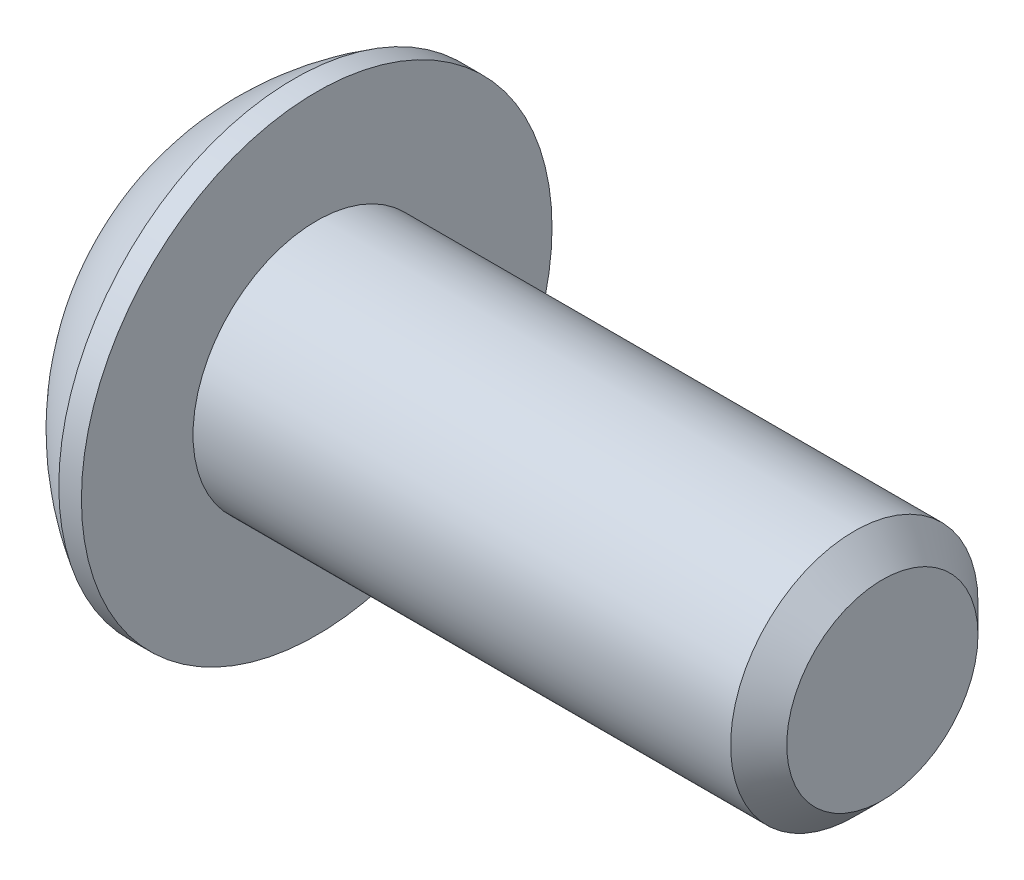
ISO-10303-21;
HEADER;
FILE_DESCRIPTION(('STEP AP214'),'2;1');
FILE_NAME('part.step','',(''),(''),'','','');
FILE_SCHEMA(('AUTOMOTIVE_DESIGN { 1 0 10303 214 1 1 1 1 }'));
ENDSEC;
DATA;
#1=APPLICATION_CONTEXT('core data for automotive mechanical design processes');
#2=APPLICATION_PROTOCOL_DEFINITION('international standard','automotive_design',2000,#1);
#3=PRODUCT_CONTEXT('',#1,'mechanical');
#4=PRODUCT('Part','Part','',(#3));
#5=PRODUCT_RELATED_PRODUCT_CATEGORY('part','',(#4));
#6=PRODUCT_DEFINITION_FORMATION('','',#4);
#7=PRODUCT_DEFINITION_CONTEXT('part definition',#1,'design');
#8=PRODUCT_DEFINITION('design','',#6,#7);
#9=PRODUCT_DEFINITION_SHAPE('','',#8);
#10=(LENGTH_UNIT() NAMED_UNIT(*) SI_UNIT(.MILLI.,.METRE.));
#11=(NAMED_UNIT(*) PLANE_ANGLE_UNIT() SI_UNIT($,.RADIAN.));
#12=(NAMED_UNIT(*) SI_UNIT($,.STERADIAN.) SOLID_ANGLE_UNIT());
#13=UNCERTAINTY_MEASURE_WITH_UNIT(LENGTH_MEASURE(1.E-05),#10,'distance_accuracy_value','');
#14=(GEOMETRIC_REPRESENTATION_CONTEXT(3) GLOBAL_UNCERTAINTY_ASSIGNED_CONTEXT((#13)) GLOBAL_UNIT_ASSIGNED_CONTEXT((#10,
#11,#12)) REPRESENTATION_CONTEXT('',''));
#15=CARTESIAN_POINT('',(0.,0.,0.));
#16=DIRECTION('',(0.,0.,1.));
#17=DIRECTION('',(1.,0.,0.));
#18=AXIS2_PLACEMENT_3D('',#15,#16,#17);
#19=CARTESIAN_POINT('',(1.32079999997359,0.,0.));
#20=DIRECTION('',(-1.,0.,0.));
#21=DIRECTION('',(0.,0.,-1.));
#22=AXIS2_PLACEMENT_3D('',#19,#20,#21);
#23=CONICAL_SURFACE('',#22,1.19380000001001,1.04719755119008);
#24=CARTESIAN_POINT('',(2.0100407513155,0.,0.));
#25=VERTEX_POINT('',#24);
#26=VERTEX_LOOP('',#25);
#27=FACE_BOUND('',#26,.T.);
#28=CARTESIAN_POINT('',(1.32079999997359,0.,0.));
#29=DIRECTION('',(1.,0.,0.));
#30=DIRECTION('',(0.,0.,-1.));
#31=AXIS2_PLACEMENT_3D('',#28,#29,#30);
#32=CIRCLE('',#31,1.19380000001001);
#33=CARTESIAN_POINT('',(1.32079999998682,-1.0338611270422,-0.596900000002503));
#34=VERTEX_POINT('',#33);
#35=CARTESIAN_POINT('',(1.32079999998682,0.,-1.19380000000501));
#36=VERTEX_POINT('',#35);
#37=EDGE_CURVE('E138',#34,#36,#32,.T.);
#38=ORIENTED_EDGE('',*,*,#37,.F.);
#39=CARTESIAN_POINT('',(1.32079999997359,0.,0.));
#40=DIRECTION('',(1.,0.,0.));
#41=DIRECTION('',(0.,0.,-1.));
#42=AXIS2_PLACEMENT_3D('',#39,#40,#41);
#43=CIRCLE('',#42,1.19380000001001);
#44=CARTESIAN_POINT('',(1.32079999998682,-1.0338611270422,0.596900000002503));
#45=VERTEX_POINT('',#44);
#46=EDGE_CURVE('E151',#45,#34,#43,.T.);
#47=ORIENTED_EDGE('',*,*,#46,.F.);
#48=CARTESIAN_POINT('',(1.32079999997359,0.,0.));
#49=DIRECTION('',(1.,0.,0.));
#50=DIRECTION('',(0.,0.,-1.));
#51=AXIS2_PLACEMENT_3D('',#48,#49,#50);
#52=CIRCLE('',#51,1.19380000001001);
#53=CARTESIAN_POINT('',(1.32079999998682,1.49461108489558E-12,1.19380000000501));
#54=VERTEX_POINT('',#53);
#55=EDGE_CURVE('E144',#54,#45,#52,.T.);
#56=ORIENTED_EDGE('',*,*,#55,.F.);
#57=CARTESIAN_POINT('',(1.32079999997359,0.,0.));
#58=DIRECTION('',(1.,0.,0.));
#59=DIRECTION('',(0.,0.,-1.));
#60=AXIS2_PLACEMENT_3D('',#57,#58,#59);
#61=CIRCLE('',#60,1.19380000001001);
#62=CARTESIAN_POINT('',(1.32079999998682,1.0338611270422,0.596900000002504));
#63=VERTEX_POINT('',#62);
#64=EDGE_CURVE('E141',#63,#54,#61,.T.);
#65=ORIENTED_EDGE('',*,*,#64,.F.);
#66=CARTESIAN_POINT('',(1.32079999997359,0.,0.));
#67=DIRECTION('',(1.,0.,0.));
#68=DIRECTION('',(0.,0.,-1.));
#69=AXIS2_PLACEMENT_3D('',#66,#67,#68);
#70=CIRCLE('',#69,1.19380000001001);
#71=CARTESIAN_POINT('',(1.32079999998682,1.0338611270422,-0.596900000002504));
#72=VERTEX_POINT('',#71);
#73=EDGE_CURVE('E41',#72,#63,#70,.T.);
#74=ORIENTED_EDGE('',*,*,#73,.F.);
#75=CARTESIAN_POINT('',(1.32079999997359,0.,0.));
#76=DIRECTION('',(1.,0.,0.));
#77=DIRECTION('',(0.,0.,-1.));
#78=AXIS2_PLACEMENT_3D('',#75,#76,#77);
#79=CIRCLE('',#78,1.19380000001001);
#80=EDGE_CURVE('E132',#36,#72,#79,.T.);
#81=ORIENTED_EDGE('',*,*,#80,.F.);
#82=EDGE_LOOP('',(#38,#47,#56,#65,#74,#81));
#83=FACE_BOUND('',#82,.T.);
#84=ADVANCED_FACE('F37',(#27,#83),#23,.F.);
#85=CARTESIAN_POINT('',(1.3208,-2.06772225407572,1.1938));
#86=DIRECTION('',(1.,0.,0.));
#87=DIRECTION('',(0.,0.,1.));
#88=AXIS2_PLACEMENT_3D('',#85,#86,#87);
#89=PLANE('',#88);
#90=DIRECTION('',(0.,-0.5,0.866025403784439));
#91=VECTOR('',#90,1.);
#92=CARTESIAN_POINT('',(1.32080000000004,1.37848150271715,0.));
#93=LINE('',#92,#91);
#94=CARTESIAN_POINT('',(1.32080000000001,1.37848150271715,0.));
#95=VERTEX_POINT('',#94);
#96=EDGE_CURVE('E128',#63,#95,#93,.F.);
#97=ORIENTED_EDGE('',*,*,#96,.T.);
#98=DIRECTION('',(0.,0.5,0.866025403784439));
#99=VECTOR('',#98,1.);
#100=CARTESIAN_POINT('',(1.3208,0.689240751358576,-1.1938));
#101=LINE('',#100,#99);
#102=EDGE_CURVE('E112',#95,#72,#101,.F.);
#103=ORIENTED_EDGE('',*,*,#102,.T.);
#104=ORIENTED_EDGE('',*,*,#73,.T.);
#105=EDGE_LOOP('',(#97,#103,#104));
#106=FACE_BOUND('',#105,.T.);
#107=ADVANCED_FACE('F124',(#106),#89,.F.);
#108=CARTESIAN_POINT('',(1.3208,-2.06772225407572,1.1938));
#109=DIRECTION('',(1.,0.,0.));
#110=DIRECTION('',(0.,0.,1.));
#111=AXIS2_PLACEMENT_3D('',#108,#109,#110);
#112=PLANE('',#111);
#113=DIRECTION('',(0.,0.5,0.866025403784439));
#114=VECTOR('',#113,1.);
#115=CARTESIAN_POINT('',(1.32080000000004,0.689240751358576,-1.1938));
#116=LINE('',#115,#114);
#117=CARTESIAN_POINT('',(1.32080000000001,0.689240751358576,-1.1938));
#118=VERTEX_POINT('',#117);
#119=EDGE_CURVE('E108',#72,#118,#116,.F.);
#120=ORIENTED_EDGE('',*,*,#119,.T.);
#121=DIRECTION('',(0.,1.,0.));
#122=VECTOR('',#121,1.);
#123=CARTESIAN_POINT('',(1.3208,-0.689240751358574,-1.1938));
#124=LINE('',#123,#122);
#125=EDGE_CURVE('E134',#118,#36,#124,.F.);
#126=ORIENTED_EDGE('',*,*,#125,.T.);
#127=ORIENTED_EDGE('',*,*,#80,.T.);
#128=EDGE_LOOP('',(#120,#126,#127));
#129=FACE_BOUND('',#128,.T.);
#130=ADVANCED_FACE('F133',(#129),#112,.F.);
#131=CARTESIAN_POINT('',(1.3208,-2.06772225407572,1.1938));
#132=DIRECTION('',(1.,0.,0.));
#133=DIRECTION('',(0.,0.,1.));
#134=AXIS2_PLACEMENT_3D('',#131,#132,#133);
#135=PLANE('',#134);
#136=DIRECTION('',(0.,1.,0.));
#137=VECTOR('',#136,1.);
#138=CARTESIAN_POINT('',(1.32080000000004,-0.689240751358574,-1.1938));
#139=LINE('',#138,#137);
#140=CARTESIAN_POINT('',(1.32080000000001,-0.689240751358574,-1.1938));
#141=VERTEX_POINT('',#140);
#142=EDGE_CURVE('E163',#36,#141,#139,.F.);
#143=ORIENTED_EDGE('',*,*,#142,.T.);
#144=DIRECTION('',(0.,0.5,-0.866025403784439));
#145=VECTOR('',#144,1.);
#146=CARTESIAN_POINT('',(1.3208,-1.37848150271715,0.));
#147=LINE('',#146,#145);
#148=EDGE_CURVE('E165',#141,#34,#147,.F.);
#149=ORIENTED_EDGE('',*,*,#148,.T.);
#150=ORIENTED_EDGE('',*,*,#37,.T.);
#151=EDGE_LOOP('',(#143,#149,#150));
#152=FACE_BOUND('',#151,.T.);
#153=ADVANCED_FACE('F162',(#152),#135,.F.);
#154=CARTESIAN_POINT('',(1.3208,-2.06772225407572,1.1938));
#155=DIRECTION('',(1.,0.,0.));
#156=DIRECTION('',(0.,0.,1.));
#157=AXIS2_PLACEMENT_3D('',#154,#155,#156);
#158=PLANE('',#157);
#159=DIRECTION('',(0.,0.5,-0.866025403784439));
#160=VECTOR('',#159,1.);
#161=CARTESIAN_POINT('',(1.32080000000004,-1.37848150271715,0.));
#162=LINE('',#161,#160);
#163=CARTESIAN_POINT('',(1.32080000000001,-1.37848150271715,0.));
#164=VERTEX_POINT('',#163);
#165=EDGE_CURVE('E170',#34,#164,#162,.F.);
#166=ORIENTED_EDGE('',*,*,#165,.T.);
#167=DIRECTION('',(0.,-0.5,-0.866025403784439));
#168=VECTOR('',#167,1.);
#169=CARTESIAN_POINT('',(1.3208,-0.689240751358574,1.1938));
#170=LINE('',#169,#168);
#171=EDGE_CURVE('E172',#164,#45,#170,.F.);
#172=ORIENTED_EDGE('',*,*,#171,.T.);
#173=ORIENTED_EDGE('',*,*,#46,.T.);
#174=EDGE_LOOP('',(#166,#172,#173));
#175=FACE_BOUND('',#174,.T.);
#176=ADVANCED_FACE('F169',(#175),#158,.F.);
#177=CARTESIAN_POINT('',(1.3208,-2.06772225407572,1.1938));
#178=DIRECTION('',(1.,0.,0.));
#179=DIRECTION('',(0.,0.,1.));
#180=AXIS2_PLACEMENT_3D('',#177,#178,#179);
#181=PLANE('',#180);
#182=DIRECTION('',(0.,-0.5,-0.866025403784439));
#183=VECTOR('',#182,1.);
#184=CARTESIAN_POINT('',(1.32080000000004,-0.689240751358574,1.1938));
#185=LINE('',#184,#183);
#186=CARTESIAN_POINT('',(1.32080000000001,-0.689240751358574,1.1938));
#187=VERTEX_POINT('',#186);
#188=EDGE_CURVE('E175',#45,#187,#185,.F.);
#189=ORIENTED_EDGE('',*,*,#188,.T.);
#190=DIRECTION('',(0.,1.,0.));
#191=VECTOR('',#190,1.);
#192=CARTESIAN_POINT('',(1.3208,0.689240751358577,1.1938));
#193=LINE('',#192,#191);
#194=EDGE_CURVE('E183',#187,#54,#193,.T.);
#195=ORIENTED_EDGE('',*,*,#194,.T.);
#196=ORIENTED_EDGE('',*,*,#55,.T.);
#197=EDGE_LOOP('',(#189,#195,#196));
#198=FACE_BOUND('',#197,.T.);
#199=ADVANCED_FACE('F181',(#198),#181,.F.);
#200=CARTESIAN_POINT('',(1.3208,-2.06772225407572,1.1938));
#201=DIRECTION('',(1.,0.,0.));
#202=DIRECTION('',(0.,0.,1.));
#203=AXIS2_PLACEMENT_3D('',#200,#201,#202);
#204=PLANE('',#203);
#205=DIRECTION('',(0.,1.,0.));
#206=VECTOR('',#205,1.);
#207=CARTESIAN_POINT('',(1.32080000000004,0.689240751358577,1.1938));
#208=LINE('',#207,#206);
#209=CARTESIAN_POINT('',(1.32080000000002,0.689240751358565,1.19380000000002));
#210=VERTEX_POINT('',#209);
#211=EDGE_CURVE('E185',#54,#210,#208,.T.);
#212=ORIENTED_EDGE('',*,*,#211,.T.);
#213=DIRECTION('',(0.,-0.5,0.866025403784439));
#214=VECTOR('',#213,1.);
#215=CARTESIAN_POINT('',(1.3208,1.37848150271715,0.));
#216=LINE('',#215,#214);
#217=EDGE_CURVE('E148',#210,#63,#216,.F.);
#218=ORIENTED_EDGE('',*,*,#217,.T.);
#219=ORIENTED_EDGE('',*,*,#64,.T.);
#220=EDGE_LOOP('',(#212,#218,#219));
#221=FACE_BOUND('',#220,.T.);
#222=ADVANCED_FACE('F309',(#221),#204,.F.);
#223=CARTESIAN_POINT('',(1.3208,1.37848150271715,0.));
#224=DIRECTION('',(0.,-0.866025403784439,-0.5));
#225=DIRECTION('',(0.,-0.5,0.866025403784439));
#226=AXIS2_PLACEMENT_3D('',#223,#224,#225);
#227=PLANE('',#226);
#228=ORIENTED_EDGE('',*,*,#96,.F.);
#229=ORIENTED_EDGE('',*,*,#217,.F.);
#230=DIRECTION('',(1.,0.,0.));
#231=VECTOR('',#230,1.);
#232=CARTESIAN_POINT('',(1.3208,0.689240751358577,1.1938));
#233=LINE('',#232,#231);
#234=CARTESIAN_POINT('',(0.,0.689240751358577,1.1938));
#235=VERTEX_POINT('',#234);
#236=EDGE_CURVE('E188',#210,#235,#233,.F.);
#237=ORIENTED_EDGE('',*,*,#236,.T.);
#238=DIRECTION('',(0.,0.5,-0.866025403784439));
#239=VECTOR('',#238,1.);
#240=CARTESIAN_POINT('',(0.,0.689240751358577,1.1938));
#241=LINE('',#240,#239);
#242=CARTESIAN_POINT('',(0.,1.37848150271715,0.));
#243=VERTEX_POINT('',#242);
#244=EDGE_CURVE('E199',#235,#243,#241,.T.);
#245=ORIENTED_EDGE('',*,*,#244,.T.);
#246=DIRECTION('',(1.,0.,0.));
#247=VECTOR('',#246,1.);
#248=CARTESIAN_POINT('',(1.3208,1.37848150271715,0.));
#249=LINE('',#248,#247);
#250=EDGE_CURVE('E129',#243,#95,#249,.T.);
#251=ORIENTED_EDGE('',*,*,#250,.T.);
#252=EDGE_LOOP('',(#228,#229,#237,#245,#251));
#253=FACE_BOUND('',#252,.T.);
#254=ADVANCED_FACE('F312',(#253),#227,.T.);
#255=CARTESIAN_POINT('',(1.3208,0.689240751358576,-1.1938));
#256=DIRECTION('',(0.,-0.866025403784439,0.5));
#257=DIRECTION('',(0.,0.5,0.866025403784439));
#258=AXIS2_PLACEMENT_3D('',#255,#256,#257);
#259=PLANE('',#258);
#260=ORIENTED_EDGE('',*,*,#119,.F.);
#261=ORIENTED_EDGE('',*,*,#102,.F.);
#262=ORIENTED_EDGE('',*,*,#250,.F.);
#263=DIRECTION('',(0.,-0.5,-0.866025403784439));
#264=VECTOR('',#263,1.);
#265=CARTESIAN_POINT('',(0.,1.37848150271715,0.));
#266=LINE('',#265,#264);
#267=CARTESIAN_POINT('',(0.,0.689240751358577,-1.1938));
#268=VERTEX_POINT('',#267);
#269=EDGE_CURVE('E243',#243,#268,#266,.T.);
#270=ORIENTED_EDGE('',*,*,#269,.T.);
#271=DIRECTION('',(1.,0.,0.));
#272=VECTOR('',#271,1.);
#273=CARTESIAN_POINT('',(1.3208,0.689240751358576,-1.1938));
#274=LINE('',#273,#272);
#275=EDGE_CURVE('E116',#268,#118,#274,.T.);
#276=ORIENTED_EDGE('',*,*,#275,.T.);
#277=EDGE_LOOP('',(#260,#261,#262,#270,#276));
#278=FACE_BOUND('',#277,.T.);
#279=ADVANCED_FACE('F110',(#278),#259,.T.);
#280=CARTESIAN_POINT('',(1.3208,-0.689240751358574,-1.1938));
#281=DIRECTION('',(0.,0.,1.));
#282=DIRECTION('',(0.,1.,0.));
#283=AXIS2_PLACEMENT_3D('',#280,#281,#282);
#284=PLANE('',#283);
#285=ORIENTED_EDGE('',*,*,#142,.F.);
#286=ORIENTED_EDGE('',*,*,#125,.F.);
#287=ORIENTED_EDGE('',*,*,#275,.F.);
#288=DIRECTION('',(0.,1.,0.));
#289=VECTOR('',#288,1.);
#290=CARTESIAN_POINT('',(0.,0.,-1.1938));
#291=LINE('',#290,#289);
#292=CARTESIAN_POINT('',(0.,-0.689240751358574,-1.1938));
#293=VERTEX_POINT('',#292);
#294=EDGE_CURVE('E228',#268,#293,#291,.F.);
#295=ORIENTED_EDGE('',*,*,#294,.T.);
#296=DIRECTION('',(1.,0.,0.));
#297=VECTOR('',#296,1.);
#298=CARTESIAN_POINT('',(1.3208,-0.689240751358574,-1.1938));
#299=LINE('',#298,#297);
#300=EDGE_CURVE('E232',#293,#141,#299,.T.);
#301=ORIENTED_EDGE('',*,*,#300,.T.);
#302=EDGE_LOOP('',(#285,#286,#287,#295,#301));
#303=FACE_BOUND('',#302,.T.);
#304=ADVANCED_FACE('F318',(#303),#284,.T.);
#305=CARTESIAN_POINT('',(1.3208,-1.37848150271715,0.));
#306=DIRECTION('',(0.,0.866025403784439,0.5));
#307=DIRECTION('',(0.,0.5,-0.866025403784439));
#308=AXIS2_PLACEMENT_3D('',#305,#306,#307);
#309=PLANE('',#308);
#310=ORIENTED_EDGE('',*,*,#165,.F.);
#311=ORIENTED_EDGE('',*,*,#148,.F.);
#312=ORIENTED_EDGE('',*,*,#300,.F.);
#313=DIRECTION('',(0.,-0.5,0.866025403784439));
#314=VECTOR('',#313,1.);
#315=CARTESIAN_POINT('',(0.,-0.689240751358574,-1.1938));
#316=LINE('',#315,#314);
#317=CARTESIAN_POINT('',(0.,-1.37848150271715,0.));
#318=VERTEX_POINT('',#317);
#319=EDGE_CURVE('E215',#293,#318,#316,.T.);
#320=ORIENTED_EDGE('',*,*,#319,.T.);
#321=DIRECTION('',(1.,0.,0.));
#322=VECTOR('',#321,1.);
#323=CARTESIAN_POINT('',(1.3208,-1.37848150271715,0.));
#324=LINE('',#323,#322);
#325=EDGE_CURVE('E176',#318,#164,#324,.T.);
#326=ORIENTED_EDGE('',*,*,#325,.T.);
#327=EDGE_LOOP('',(#310,#311,#312,#320,#326));
#328=FACE_BOUND('',#327,.T.);
#329=ADVANCED_FACE('F321',(#328),#309,.T.);
#330=CARTESIAN_POINT('',(1.3208,-0.689240751358574,1.1938));
#331=DIRECTION('',(0.,0.866025403784439,-0.5));
#332=DIRECTION('',(0.,-0.5,-0.866025403784439));
#333=AXIS2_PLACEMENT_3D('',#330,#331,#332);
#334=PLANE('',#333);
#335=ORIENTED_EDGE('',*,*,#188,.F.);
#336=ORIENTED_EDGE('',*,*,#171,.F.);
#337=ORIENTED_EDGE('',*,*,#325,.F.);
#338=DIRECTION('',(0.,0.5,0.866025403784439));
#339=VECTOR('',#338,1.);
#340=CARTESIAN_POINT('',(0.,-1.37848150271715,0.));
#341=LINE('',#340,#339);
#342=CARTESIAN_POINT('',(0.,-0.689240751358574,1.1938));
#343=VERTEX_POINT('',#342);
#344=EDGE_CURVE('E210',#318,#343,#341,.T.);
#345=ORIENTED_EDGE('',*,*,#344,.T.);
#346=DIRECTION('',(1.,0.,0.));
#347=VECTOR('',#346,1.);
#348=CARTESIAN_POINT('',(1.3208,-0.689240751358574,1.1938));
#349=LINE('',#348,#347);
#350=EDGE_CURVE('E186',#343,#187,#349,.T.);
#351=ORIENTED_EDGE('',*,*,#350,.T.);
#352=EDGE_LOOP('',(#335,#336,#337,#345,#351));
#353=FACE_BOUND('',#352,.T.);
#354=ADVANCED_FACE('F325',(#353),#334,.T.);
#355=CARTESIAN_POINT('',(1.3208,0.689240751358577,1.1938));
#356=DIRECTION('',(0.,0.,-1.));
#357=DIRECTION('',(1.,0.,0.));
#358=AXIS2_PLACEMENT_3D('',#355,#356,#357);
#359=PLANE('',#358);
#360=ORIENTED_EDGE('',*,*,#211,.F.);
#361=ORIENTED_EDGE('',*,*,#194,.F.);
#362=ORIENTED_EDGE('',*,*,#350,.F.);
#363=DIRECTION('',(0.,1.,0.));
#364=VECTOR('',#363,1.);
#365=CARTESIAN_POINT('',(0.,0.,1.1938));
#366=LINE('',#365,#364);
#367=EDGE_CURVE('E56',#343,#235,#366,.T.);
#368=ORIENTED_EDGE('',*,*,#367,.T.);
#369=ORIENTED_EDGE('',*,*,#236,.F.);
#370=EDGE_LOOP('',(#360,#361,#362,#368,#369));
#371=FACE_BOUND('',#370,.T.);
#372=ADVANCED_FACE('F292',(#371),#359,.T.);
#373=CARTESIAN_POINT('',(0.,0.,0.));
#374=DIRECTION('',(-1.,0.,0.));
#375=DIRECTION('',(0.,0.,-1.));
#376=AXIS2_PLACEMENT_3D('',#373,#374,#375);
#377=PLANE('',#376);
#378=CARTESIAN_POINT('',(0.,0.,0.));
#379=DIRECTION('',(1.,0.,0.));
#380=DIRECTION('',(0.,0.,-1.));
#381=AXIS2_PLACEMENT_3D('',#378,#379,#380);
#382=CIRCLE('',#381,1.9812);
#383=CARTESIAN_POINT('',(0.,0.,-1.9812));
#384=VERTEX_POINT('',#383);
#385=EDGE_CURVE('E154',#384,#384,#382,.F.);
#386=ORIENTED_EDGE('',*,*,#385,.T.);
#387=EDGE_LOOP('',(#386));
#388=FACE_BOUND('',#387,.T.);
#389=ORIENTED_EDGE('',*,*,#344,.F.);
#390=ORIENTED_EDGE('',*,*,#319,.F.);
#391=ORIENTED_EDGE('',*,*,#294,.F.);
#392=ORIENTED_EDGE('',*,*,#269,.F.);
#393=ORIENTED_EDGE('',*,*,#244,.F.);
#394=ORIENTED_EDGE('',*,*,#367,.F.);
#395=EDGE_LOOP('',(#389,#390,#391,#392,#393,#394));
#396=FACE_BOUND('',#395,.T.);
#397=ADVANCED_FACE('F281',(#388,#396),#377,.T.);
#398=CARTESIAN_POINT('',(4.13385,0.,0.));
#399=DIRECTION('',(0.,1.,0.));
#400=DIRECTION('',(-0.489667403954941,0.,0.871909303485189));
#401=AXIS2_PLACEMENT_3D('',#398,#399,#400);
#402=SPHERICAL_SURFACE('',#401,4.58408870578439);
#403=CARTESIAN_POINT('',(4.13385,0.,0.));
#404=DIRECTION('',(1.,0.,0.));
#405=DIRECTION('',(0.,0.,-1.));
#406=AXIS2_PLACEMENT_3D('',#403,#404,#405);
#407=SPHERICAL_SURFACE('',#406,4.58408870578439);
#408=ORIENTED_EDGE('',*,*,#385,.F.);
#409=EDGE_LOOP('',(#408));
#410=FACE_BOUND('',#409,.T.);
#411=CARTESIAN_POINT('',(1.8288,0.,0.));
#412=DIRECTION('',(1.,0.,0.));
#413=DIRECTION('',(0.,0.,-1.));
#414=AXIS2_PLACEMENT_3D('',#411,#412,#413);
#415=CIRCLE('',#414,3.9624);
#416=CARTESIAN_POINT('',(1.8288,0.,-3.9624));
#417=VERTEX_POINT('',#416);
#418=EDGE_CURVE('E274',#417,#417,#415,.F.);
#419=ORIENTED_EDGE('',*,*,#418,.T.);
#420=EDGE_LOOP('',(#419));
#421=FACE_BOUND('',#420,.T.);
#422=ADVANCED_FACE('F39',(#410,#421),#407,.T.);
#423=CARTESIAN_POINT('',(11.7348,0.,0.));
#424=DIRECTION('',(-1.,0.,0.));
#425=DIRECTION('',(0.,0.,-1.));
#426=AXIS2_PLACEMENT_3D('',#423,#424,#425);
#427=PLANE('',#426);
#428=CARTESIAN_POINT('',(11.7347999999993,0.,0.));
#429=DIRECTION('',(1.,0.,0.));
#430=DIRECTION('',(0.,0.,-1.));
#431=AXIS2_PLACEMENT_3D('',#428,#429,#430);
#432=CIRCLE('',#431,1.61035999997239);
#433=CARTESIAN_POINT('',(11.7347999999993,0.,-1.61035999997239));
#434=VERTEX_POINT('',#433);
#435=EDGE_CURVE('E272',#434,#434,#432,.T.);
#436=ORIENTED_EDGE('',*,*,#435,.T.);
#437=EDGE_LOOP('',(#436));
#438=FACE_BOUND('',#437,.T.);
#439=ADVANCED_FACE('F284',(#438),#427,.F.);
#440=CARTESIAN_POINT('',(0.,0.,0.));
#441=DIRECTION('',(-1.,0.,0.));
#442=DIRECTION('',(0.,0.,-1.));
#443=AXIS2_PLACEMENT_3D('',#440,#441,#442);
#444=CYLINDRICAL_SURFACE('',#443,3.9624);
#445=ORIENTED_EDGE('',*,*,#418,.F.);
#446=EDGE_LOOP('',(#445));
#447=FACE_BOUND('',#446,.T.);
#448=CARTESIAN_POINT('',(2.2098,0.,0.));
#449=DIRECTION('',(1.,0.,0.));
#450=DIRECTION('',(0.,0.,-1.));
#451=AXIS2_PLACEMENT_3D('',#448,#449,#450);
#452=CIRCLE('',#451,3.9624);
#453=CARTESIAN_POINT('',(2.2098,0.,-3.9624));
#454=VERTEX_POINT('',#453);
#455=EDGE_CURVE('E269',#454,#454,#452,.T.);
#456=ORIENTED_EDGE('',*,*,#455,.F.);
#457=EDGE_LOOP('',(#456));
#458=FACE_BOUND('',#457,.T.);
#459=ADVANCED_FACE('F289',(#447,#458),#444,.T.);
#460=CARTESIAN_POINT('',(11.2623600001029,0.,0.));
#461=DIRECTION('',(-1.,0.,0.));
#462=DIRECTION('',(0.,0.,-1.));
#463=AXIS2_PLACEMENT_3D('',#460,#461,#462);
#464=CONICAL_SURFACE('',#463,2.08279999986871,0.785398163397448);
#465=CARTESIAN_POINT('',(11.26236,0.,0.));
#466=DIRECTION('',(1.,0.,0.));
#467=DIRECTION('',(0.,0.,-1.));
#468=AXIS2_PLACEMENT_3D('',#465,#466,#467);
#469=CIRCLE('',#468,2.0828);
#470=CARTESIAN_POINT('',(11.26236,0.,-2.0828));
#471=VERTEX_POINT('',#470);
#472=EDGE_CURVE('E47',#471,#471,#469,.T.);
#473=ORIENTED_EDGE('',*,*,#472,.T.);
#474=EDGE_LOOP('',(#473));
#475=FACE_BOUND('',#474,.T.);
#476=ORIENTED_EDGE('',*,*,#435,.F.);
#477=EDGE_LOOP('',(#476));
#478=FACE_BOUND('',#477,.T.);
#479=ADVANCED_FACE('F333',(#475,#478),#464,.T.);
#480=CARTESIAN_POINT('',(2.2098,2.0828,0.));
#481=DIRECTION('',(-1.,0.,0.));
#482=DIRECTION('',(0.,0.,-1.));
#483=AXIS2_PLACEMENT_3D('',#480,#481,#482);
#484=PLANE('',#483);
#485=ORIENTED_EDGE('',*,*,#455,.T.);
#486=EDGE_LOOP('',(#485));
#487=FACE_BOUND('',#486,.T.);
#488=CARTESIAN_POINT('',(2.2098,0.,0.));
#489=DIRECTION('',(1.,0.,0.));
#490=DIRECTION('',(0.,0.,-1.));
#491=AXIS2_PLACEMENT_3D('',#488,#489,#490);
#492=CIRCLE('',#491,2.0828);
#493=CARTESIAN_POINT('',(2.2098,0.,-2.0828));
#494=VERTEX_POINT('',#493);
#495=EDGE_CURVE('E11',#494,#494,#492,.F.);
#496=ORIENTED_EDGE('',*,*,#495,.T.);
#497=EDGE_LOOP('',(#496));
#498=FACE_BOUND('',#497,.T.);
#499=ADVANCED_FACE('F337',(#487,#498),#484,.F.);
#500=CARTESIAN_POINT('',(0.,0.,0.));
#501=DIRECTION('',(-1.,0.,0.));
#502=DIRECTION('',(0.,0.,-1.));
#503=AXIS2_PLACEMENT_3D('',#500,#501,#502);
#504=CYLINDRICAL_SURFACE('',#503,2.0828);
#505=ORIENTED_EDGE('',*,*,#495,.F.);
#506=EDGE_LOOP('',(#505));
#507=FACE_BOUND('',#506,.T.);
#508=ORIENTED_EDGE('',*,*,#472,.F.);
#509=EDGE_LOOP('',(#508));
#510=FACE_BOUND('',#509,.T.);
#511=ADVANCED_FACE('F341',(#507,#510),#504,.T.);
#512=CLOSED_SHELL('',(#84,#107,#130,#153,#176,#199,#222,#254,#279,#304,#329,#354,#372,#397,#422,
#439,#459,#479,#499,#511));
#513=MANIFOLD_SOLID_BREP('B2',#512);
#514=ADVANCED_BREP_SHAPE_REPRESENTATION('',(#18,#513),#14);
#515=SHAPE_DEFINITION_REPRESENTATION(#9,#514);
ENDSEC;
END-ISO-10303-21;
